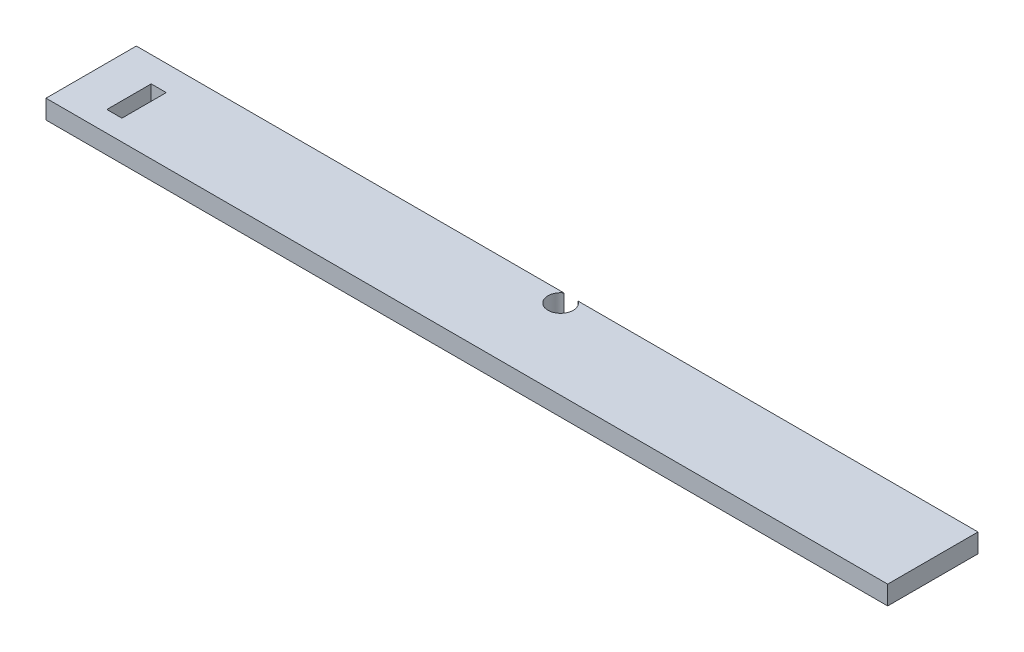
ISO-10303-21;
HEADER;
FILE_DESCRIPTION(('STEP AP214'),'2;1');
FILE_NAME('part.step','',(''),(''),'','','');
FILE_SCHEMA(('AUTOMOTIVE_DESIGN { 1 0 10303 214 1 1 1 1 }'));
ENDSEC;
DATA;
#1=APPLICATION_CONTEXT('core data for automotive mechanical design processes');
#2=APPLICATION_PROTOCOL_DEFINITION('international standard','automotive_design',2000,#1);
#3=PRODUCT_CONTEXT('',#1,'mechanical');
#4=PRODUCT('Part','Part','',(#3));
#5=PRODUCT_RELATED_PRODUCT_CATEGORY('part','',(#4));
#6=PRODUCT_DEFINITION_FORMATION('','',#4);
#7=PRODUCT_DEFINITION_CONTEXT('part definition',#1,'design');
#8=PRODUCT_DEFINITION('design','',#6,#7);
#9=PRODUCT_DEFINITION_SHAPE('','',#8);
#10=(LENGTH_UNIT() NAMED_UNIT(*) SI_UNIT(.MILLI.,.METRE.));
#11=(NAMED_UNIT(*) PLANE_ANGLE_UNIT() SI_UNIT($,.RADIAN.));
#12=(NAMED_UNIT(*) SI_UNIT($,.STERADIAN.) SOLID_ANGLE_UNIT());
#13=UNCERTAINTY_MEASURE_WITH_UNIT(LENGTH_MEASURE(1.E-05),#10,'distance_accuracy_value','');
#14=(GEOMETRIC_REPRESENTATION_CONTEXT(3) GLOBAL_UNCERTAINTY_ASSIGNED_CONTEXT((#13)) GLOBAL_UNIT_ASSIGNED_CONTEXT((#10,
#11,#12)) REPRESENTATION_CONTEXT('',''));
#15=CARTESIAN_POINT('',(0.,0.,0.));
#16=DIRECTION('',(0.,0.,1.));
#17=DIRECTION('',(1.,0.,0.));
#18=AXIS2_PLACEMENT_3D('',#15,#16,#17);
#19=CARTESIAN_POINT('',(0.,19.05,-90.8304));
#20=DIRECTION('',(0.,0.,1.));
#21=DIRECTION('',(1.,0.,0.));
#22=AXIS2_PLACEMENT_3D('',#19,#20,#21);
#23=PLANE('',#22);
#24=DIRECTION('',(-1.,0.,0.));
#25=VECTOR('',#24,1.);
#26=CARTESIAN_POINT('',(0.,19.05,-90.8304));
#27=LINE('',#26,#25);
#28=CARTESIAN_POINT('',(429.949989523099,19.05,-90.8304));
#29=VERTEX_POINT('',#28);
#30=CARTESIAN_POINT('',(0.,19.05,-90.8304));
#31=VERTEX_POINT('',#30);
#32=EDGE_CURVE('E172',#29,#31,#27,.T.);
#33=ORIENTED_EDGE('',*,*,#32,.F.);
#34=DIRECTION('',(0.,-1.,0.));
#35=VECTOR('',#34,1.);
#36=CARTESIAN_POINT('',(429.949989523099,19.05,-90.8304));
#37=LINE('',#36,#35);
#38=CARTESIAN_POINT('',(429.949989523099,0.,-90.8304));
#39=VERTEX_POINT('',#38);
#40=EDGE_CURVE('E160',#29,#39,#37,.T.);
#41=ORIENTED_EDGE('',*,*,#40,.T.);
#42=DIRECTION('',(-1.,0.,0.));
#43=VECTOR('',#42,1.);
#44=CARTESIAN_POINT('',(0.,0.,-90.8304));
#45=LINE('',#44,#43);
#46=CARTESIAN_POINT('',(0.,0.,-90.8304));
#47=VERTEX_POINT('',#46);
#48=EDGE_CURVE('E183',#39,#47,#45,.T.);
#49=ORIENTED_EDGE('',*,*,#48,.T.);
#50=DIRECTION('',(0.,-1.,0.));
#51=VECTOR('',#50,1.);
#52=CARTESIAN_POINT('',(0.,19.05,-90.8304));
#53=LINE('',#52,#51);
#54=EDGE_CURVE('E176',#31,#47,#53,.T.);
#55=ORIENTED_EDGE('',*,*,#54,.F.);
#56=EDGE_LOOP('',(#33,#41,#49,#55));
#57=FACE_BOUND('',#56,.T.);
#58=ADVANCED_FACE('F39',(#57),#23,.F.);
#59=CARTESIAN_POINT('',(0.,19.05,0.));
#60=DIRECTION('',(1.,0.,0.));
#61=DIRECTION('',(0.,0.,-1.));
#62=AXIS2_PLACEMENT_3D('',#59,#60,#61);
#63=PLANE('',#62);
#64=DIRECTION('',(0.,0.,1.));
#65=VECTOR('',#64,1.);
#66=CARTESIAN_POINT('',(0.,0.,0.));
#67=LINE('',#66,#65);
#68=CARTESIAN_POINT('',(0.,0.,0.));
#69=VERTEX_POINT('',#68);
#70=EDGE_CURVE('E163',#47,#69,#67,.T.);
#71=ORIENTED_EDGE('',*,*,#70,.T.);
#72=DIRECTION('',(0.,-1.,0.));
#73=VECTOR('',#72,1.);
#74=CARTESIAN_POINT('',(0.,19.05,0.));
#75=LINE('',#74,#73);
#76=CARTESIAN_POINT('',(0.,19.05,0.));
#77=VERTEX_POINT('',#76);
#78=EDGE_CURVE('E11',#77,#69,#75,.T.);
#79=ORIENTED_EDGE('',*,*,#78,.F.);
#80=DIRECTION('',(0.,0.,1.));
#81=VECTOR('',#80,1.);
#82=CARTESIAN_POINT('',(0.,19.05,0.));
#83=LINE('',#82,#81);
#84=EDGE_CURVE('E164',#31,#77,#83,.T.);
#85=ORIENTED_EDGE('',*,*,#84,.F.);
#86=ORIENTED_EDGE('',*,*,#54,.T.);
#87=EDGE_LOOP('',(#71,#79,#85,#86));
#88=FACE_BOUND('',#87,.T.);
#89=ADVANCED_FACE('F41',(#88),#63,.F.);
#90=CARTESIAN_POINT('',(0.,19.05,0.));
#91=DIRECTION('',(0.,0.,-1.));
#92=DIRECTION('',(-1.,0.,0.));
#93=AXIS2_PLACEMENT_3D('',#90,#91,#92);
#94=PLANE('',#93);
#95=DIRECTION('',(1.,0.,0.));
#96=VECTOR('',#95,1.);
#97=CARTESIAN_POINT('',(0.,0.,0.));
#98=LINE('',#97,#96);
#99=CARTESIAN_POINT('',(846.328,0.,0.));
#100=VERTEX_POINT('',#99);
#101=EDGE_CURVE('E179',#69,#100,#98,.T.);
#102=ORIENTED_EDGE('',*,*,#101,.T.);
#103=DIRECTION('',(0.,-1.,0.));
#104=VECTOR('',#103,1.);
#105=CARTESIAN_POINT('',(846.328,19.05,0.));
#106=LINE('',#105,#104);
#107=CARTESIAN_POINT('',(846.328,19.05,0.));
#108=VERTEX_POINT('',#107);
#109=EDGE_CURVE('E47',#108,#100,#106,.T.);
#110=ORIENTED_EDGE('',*,*,#109,.F.);
#111=DIRECTION('',(1.,0.,0.));
#112=VECTOR('',#111,1.);
#113=CARTESIAN_POINT('',(0.,19.05,0.));
#114=LINE('',#113,#112);
#115=EDGE_CURVE('E167',#77,#108,#114,.T.);
#116=ORIENTED_EDGE('',*,*,#115,.F.);
#117=ORIENTED_EDGE('',*,*,#78,.T.);
#118=EDGE_LOOP('',(#102,#110,#116,#117));
#119=FACE_BOUND('',#118,.T.);
#120=ADVANCED_FACE('F210',(#119),#94,.F.);
#121=CARTESIAN_POINT('',(846.328,19.05,0.));
#122=DIRECTION('',(-1.,0.,0.));
#123=DIRECTION('',(0.,0.,1.));
#124=AXIS2_PLACEMENT_3D('',#121,#122,#123);
#125=PLANE('',#124);
#126=DIRECTION('',(0.,0.,-1.));
#127=VECTOR('',#126,1.);
#128=CARTESIAN_POINT('',(846.328,0.,0.));
#129=LINE('',#128,#127);
#130=CARTESIAN_POINT('',(846.328,0.,-90.8304));
#131=VERTEX_POINT('',#130);
#132=EDGE_CURVE('E181',#100,#131,#129,.T.);
#133=ORIENTED_EDGE('',*,*,#132,.T.);
#134=DIRECTION('',(0.,-1.,0.));
#135=VECTOR('',#134,1.);
#136=CARTESIAN_POINT('',(846.328,19.05,-90.8304));
#137=LINE('',#136,#135);
#138=CARTESIAN_POINT('',(846.328,19.05,-90.8304));
#139=VERTEX_POINT('',#138);
#140=EDGE_CURVE('E188',#139,#131,#137,.T.);
#141=ORIENTED_EDGE('',*,*,#140,.F.);
#142=DIRECTION('',(0.,0.,-1.));
#143=VECTOR('',#142,1.);
#144=CARTESIAN_POINT('',(846.328,19.05,0.));
#145=LINE('',#144,#143);
#146=EDGE_CURVE('E170',#108,#139,#145,.T.);
#147=ORIENTED_EDGE('',*,*,#146,.F.);
#148=ORIENTED_EDGE('',*,*,#109,.T.);
#149=EDGE_LOOP('',(#133,#141,#147,#148));
#150=FACE_BOUND('',#149,.T.);
#151=ADVANCED_FACE('F195',(#150),#125,.F.);
#152=CARTESIAN_POINT('',(444.267210476901,0.,-90.8304));
#153=VERTEX_POINT('',#152);
#154=EDGE_CURVE('E168',#131,#153,#45,.T.);
#155=ORIENTED_EDGE('',*,*,#154,.T.);
#156=DIRECTION('',(0.,-1.,0.));
#157=VECTOR('',#156,1.);
#158=CARTESIAN_POINT('',(444.267210476901,19.05,-90.8304));
#159=LINE('',#158,#157);
#160=CARTESIAN_POINT('',(444.267210476901,19.05,-90.8304));
#161=VERTEX_POINT('',#160);
#162=EDGE_CURVE('E156',#153,#161,#159,.F.);
#163=ORIENTED_EDGE('',*,*,#162,.T.);
#164=EDGE_CURVE('E173',#139,#161,#27,.T.);
#165=ORIENTED_EDGE('',*,*,#164,.F.);
#166=ORIENTED_EDGE('',*,*,#140,.T.);
#167=EDGE_LOOP('',(#155,#163,#165,#166));
#168=FACE_BOUND('',#167,.T.);
#169=ADVANCED_FACE('F205',(#168),#23,.F.);
#170=CARTESIAN_POINT('',(0.,19.05,0.));
#171=DIRECTION('',(0.,-1.,0.));
#172=DIRECTION('',(0.,0.,-1.));
#173=AXIS2_PLACEMENT_3D('',#170,#171,#172);
#174=PLANE('',#173);
#175=DIRECTION('',(1.,0.,0.));
#176=VECTOR('',#175,1.);
#177=CARTESIAN_POINT('',(55.6026936391248,19.05,-65.3401775270846));
#178=LINE('',#177,#176);
#179=CARTESIAN_POINT('',(40.4459618919897,19.05,-65.3401775270846));
#180=VERTEX_POINT('',#179);
#181=CARTESIAN_POINT('',(55.6026936391248,19.05,-65.3401775270846));
#182=VERTEX_POINT('',#181);
#183=EDGE_CURVE('E124',#180,#182,#178,.T.);
#184=ORIENTED_EDGE('',*,*,#183,.T.);
#185=DIRECTION('',(0.,0.,1.));
#186=VECTOR('',#185,1.);
#187=CARTESIAN_POINT('',(55.6026936391248,19.05,-65.3401775270846));
#188=LINE('',#187,#186);
#189=CARTESIAN_POINT('',(55.6026936391248,19.05,-20.761554741393));
#190=VERTEX_POINT('',#189);
#191=EDGE_CURVE('E118',#182,#190,#188,.T.);
#192=ORIENTED_EDGE('',*,*,#191,.T.);
#193=DIRECTION('',(-1.,0.,0.));
#194=VECTOR('',#193,1.);
#195=CARTESIAN_POINT('',(55.6026936391248,19.05,-20.761554741393));
#196=LINE('',#195,#194);
#197=CARTESIAN_POINT('',(40.4459618919897,19.05,-20.761554741393));
#198=VERTEX_POINT('',#197);
#199=EDGE_CURVE('E127',#190,#198,#196,.T.);
#200=ORIENTED_EDGE('',*,*,#199,.T.);
#201=DIRECTION('',(0.,0.,-1.));
#202=VECTOR('',#201,1.);
#203=CARTESIAN_POINT('',(40.4459618919897,19.05,-65.3401775270846));
#204=LINE('',#203,#202);
#205=EDGE_CURVE('E54',#198,#180,#204,.T.);
#206=ORIENTED_EDGE('',*,*,#205,.T.);
#207=EDGE_LOOP('',(#184,#192,#200,#206));
#208=FACE_BOUND('',#207,.T.);
#209=ORIENTED_EDGE('',*,*,#164,.T.);
#210=CARTESIAN_POINT('',(437.1086,19.05,-80.3402));
#211=DIRECTION('',(0.,-1.,0.));
#212=DIRECTION('',(0.,0.,-1.));
#213=AXIS2_PLACEMENT_3D('',#210,#211,#212);
#214=CIRCLE('',#213,12.7);
#215=EDGE_CURVE('E153',#161,#29,#214,.T.);
#216=ORIENTED_EDGE('',*,*,#215,.T.);
#217=ORIENTED_EDGE('',*,*,#32,.T.);
#218=ORIENTED_EDGE('',*,*,#84,.T.);
#219=ORIENTED_EDGE('',*,*,#115,.T.);
#220=ORIENTED_EDGE('',*,*,#146,.T.);
#221=EDGE_LOOP('',(#209,#216,#217,#218,#219,#220));
#222=FACE_BOUND('',#221,.T.);
#223=ADVANCED_FACE('F131',(#208,#222),#174,.F.);
#224=CARTESIAN_POINT('',(0.,0.,0.));
#225=DIRECTION('',(0.,-1.,0.));
#226=DIRECTION('',(0.,0.,-1.));
#227=AXIS2_PLACEMENT_3D('',#224,#225,#226);
#228=PLANE('',#227);
#229=DIRECTION('',(0.,0.,1.));
#230=VECTOR('',#229,1.);
#231=CARTESIAN_POINT('',(55.6026936391248,0.,-65.3401775270846));
#232=LINE('',#231,#230);
#233=CARTESIAN_POINT('',(55.6026936391248,0.,-65.3401775270846));
#234=VERTEX_POINT('',#233);
#235=CARTESIAN_POINT('',(55.6026936391248,0.,-20.761554741393));
#236=VERTEX_POINT('',#235);
#237=EDGE_CURVE('E62',#234,#236,#232,.T.);
#238=ORIENTED_EDGE('',*,*,#237,.F.);
#239=DIRECTION('',(1.,0.,0.));
#240=VECTOR('',#239,1.);
#241=CARTESIAN_POINT('',(55.6026936391248,0.,-65.3401775270846));
#242=LINE('',#241,#240);
#243=CARTESIAN_POINT('',(40.4459618919897,0.,-65.3401775270846));
#244=VERTEX_POINT('',#243);
#245=EDGE_CURVE('E134',#244,#234,#242,.T.);
#246=ORIENTED_EDGE('',*,*,#245,.F.);
#247=DIRECTION('',(0.,0.,-1.));
#248=VECTOR('',#247,1.);
#249=CARTESIAN_POINT('',(40.4459618919897,0.,-65.3401775270846));
#250=LINE('',#249,#248);
#251=CARTESIAN_POINT('',(40.4459618919897,0.,-20.761554741393));
#252=VERTEX_POINT('',#251);
#253=EDGE_CURVE('E137',#252,#244,#250,.T.);
#254=ORIENTED_EDGE('',*,*,#253,.F.);
#255=DIRECTION('',(-1.,0.,0.));
#256=VECTOR('',#255,1.);
#257=CARTESIAN_POINT('',(55.6026936391248,0.,-20.761554741393));
#258=LINE('',#257,#256);
#259=EDGE_CURVE('E143',#236,#252,#258,.T.);
#260=ORIENTED_EDGE('',*,*,#259,.F.);
#261=EDGE_LOOP('',(#238,#246,#254,#260));
#262=FACE_BOUND('',#261,.T.);
#263=CARTESIAN_POINT('',(437.1086,0.,-80.3402));
#264=DIRECTION('',(0.,-1.,0.));
#265=DIRECTION('',(0.,0.,-1.));
#266=AXIS2_PLACEMENT_3D('',#263,#264,#265);
#267=CIRCLE('',#266,12.7);
#268=EDGE_CURVE('E149',#153,#39,#267,.T.);
#269=ORIENTED_EDGE('',*,*,#268,.F.);
#270=ORIENTED_EDGE('',*,*,#154,.F.);
#271=ORIENTED_EDGE('',*,*,#132,.F.);
#272=ORIENTED_EDGE('',*,*,#101,.F.);
#273=ORIENTED_EDGE('',*,*,#70,.F.);
#274=ORIENTED_EDGE('',*,*,#48,.F.);
#275=EDGE_LOOP('',(#269,#270,#271,#272,#273,#274));
#276=FACE_BOUND('',#275,.T.);
#277=ADVANCED_FACE('F201',(#262,#276),#228,.T.);
#278=CARTESIAN_POINT('',(437.1086,19.05,-80.3402));
#279=DIRECTION('',(0.,-1.,0.));
#280=DIRECTION('',(0.,0.,-1.));
#281=AXIS2_PLACEMENT_3D('',#278,#279,#280);
#282=CYLINDRICAL_SURFACE('',#281,12.7);
#283=ORIENTED_EDGE('',*,*,#215,.F.);
#284=ORIENTED_EDGE('',*,*,#162,.F.);
#285=ORIENTED_EDGE('',*,*,#268,.T.);
#286=ORIENTED_EDGE('',*,*,#40,.F.);
#287=EDGE_LOOP('',(#283,#284,#285,#286));
#288=FACE_BOUND('',#287,.T.);
#289=ADVANCED_FACE('F215',(#288),#282,.F.);
#290=CARTESIAN_POINT('',(55.6026936391248,19.05,-65.3401775270846));
#291=DIRECTION('',(1.,0.,0.));
#292=DIRECTION('',(0.,0.,-1.));
#293=AXIS2_PLACEMENT_3D('',#290,#291,#292);
#294=PLANE('',#293);
#295=ORIENTED_EDGE('',*,*,#237,.T.);
#296=DIRECTION('',(0.,-1.,0.));
#297=VECTOR('',#296,1.);
#298=CARTESIAN_POINT('',(55.6026936391248,19.05,-20.761554741393));
#299=LINE('',#298,#297);
#300=EDGE_CURVE('E114',#190,#236,#299,.T.);
#301=ORIENTED_EDGE('',*,*,#300,.F.);
#302=ORIENTED_EDGE('',*,*,#191,.F.);
#303=DIRECTION('',(0.,-1.,0.));
#304=VECTOR('',#303,1.);
#305=CARTESIAN_POINT('',(55.6026936391248,19.05,-65.3401775270846));
#306=LINE('',#305,#304);
#307=EDGE_CURVE('E147',#182,#234,#306,.T.);
#308=ORIENTED_EDGE('',*,*,#307,.T.);
#309=EDGE_LOOP('',(#295,#301,#302,#308));
#310=FACE_BOUND('',#309,.T.);
#311=ADVANCED_FACE('F116',(#310),#294,.F.);
#312=CARTESIAN_POINT('',(55.6026936391248,19.05,-65.3401775270846));
#313=DIRECTION('',(0.,0.,-1.));
#314=DIRECTION('',(-1.,0.,0.));
#315=AXIS2_PLACEMENT_3D('',#312,#313,#314);
#316=PLANE('',#315);
#317=ORIENTED_EDGE('',*,*,#245,.T.);
#318=ORIENTED_EDGE('',*,*,#307,.F.);
#319=ORIENTED_EDGE('',*,*,#183,.F.);
#320=DIRECTION('',(0.,-1.,0.));
#321=VECTOR('',#320,1.);
#322=CARTESIAN_POINT('',(40.4459618919897,19.05,-65.3401775270846));
#323=LINE('',#322,#321);
#324=EDGE_CURVE('E150',#180,#244,#323,.T.);
#325=ORIENTED_EDGE('',*,*,#324,.T.);
#326=EDGE_LOOP('',(#317,#318,#319,#325));
#327=FACE_BOUND('',#326,.T.);
#328=ADVANCED_FACE('F223',(#327),#316,.F.);
#329=CARTESIAN_POINT('',(40.4459618919897,19.05,-65.3401775270846));
#330=DIRECTION('',(-1.,0.,0.));
#331=DIRECTION('',(0.,0.,1.));
#332=AXIS2_PLACEMENT_3D('',#329,#330,#331);
#333=PLANE('',#332);
#334=ORIENTED_EDGE('',*,*,#253,.T.);
#335=ORIENTED_EDGE('',*,*,#324,.F.);
#336=ORIENTED_EDGE('',*,*,#205,.F.);
#337=DIRECTION('',(0.,-1.,0.));
#338=VECTOR('',#337,1.);
#339=CARTESIAN_POINT('',(40.4459618919897,19.05,-20.761554741393));
#340=LINE('',#339,#338);
#341=EDGE_CURVE('E123',#198,#252,#340,.T.);
#342=ORIENTED_EDGE('',*,*,#341,.T.);
#343=EDGE_LOOP('',(#334,#335,#336,#342));
#344=FACE_BOUND('',#343,.T.);
#345=ADVANCED_FACE('F289',(#344),#333,.F.);
#346=CARTESIAN_POINT('',(55.6026936391248,19.05,-20.761554741393));
#347=DIRECTION('',(0.,0.,1.));
#348=DIRECTION('',(1.,0.,0.));
#349=AXIS2_PLACEMENT_3D('',#346,#347,#348);
#350=PLANE('',#349);
#351=ORIENTED_EDGE('',*,*,#259,.T.);
#352=ORIENTED_EDGE('',*,*,#341,.F.);
#353=ORIENTED_EDGE('',*,*,#199,.F.);
#354=ORIENTED_EDGE('',*,*,#300,.T.);
#355=EDGE_LOOP('',(#351,#352,#353,#354));
#356=FACE_BOUND('',#355,.T.);
#357=ADVANCED_FACE('F128',(#356),#350,.F.);
#358=CLOSED_SHELL('',(#58,#89,#120,#151,#169,#223,#277,#289,#311,#328,#345,#357));
#359=MANIFOLD_SOLID_BREP('B2',#358);
#360=ADVANCED_BREP_SHAPE_REPRESENTATION('',(#18,#359),#14);
#361=SHAPE_DEFINITION_REPRESENTATION(#9,#360);
ENDSEC;
END-ISO-10303-21;
